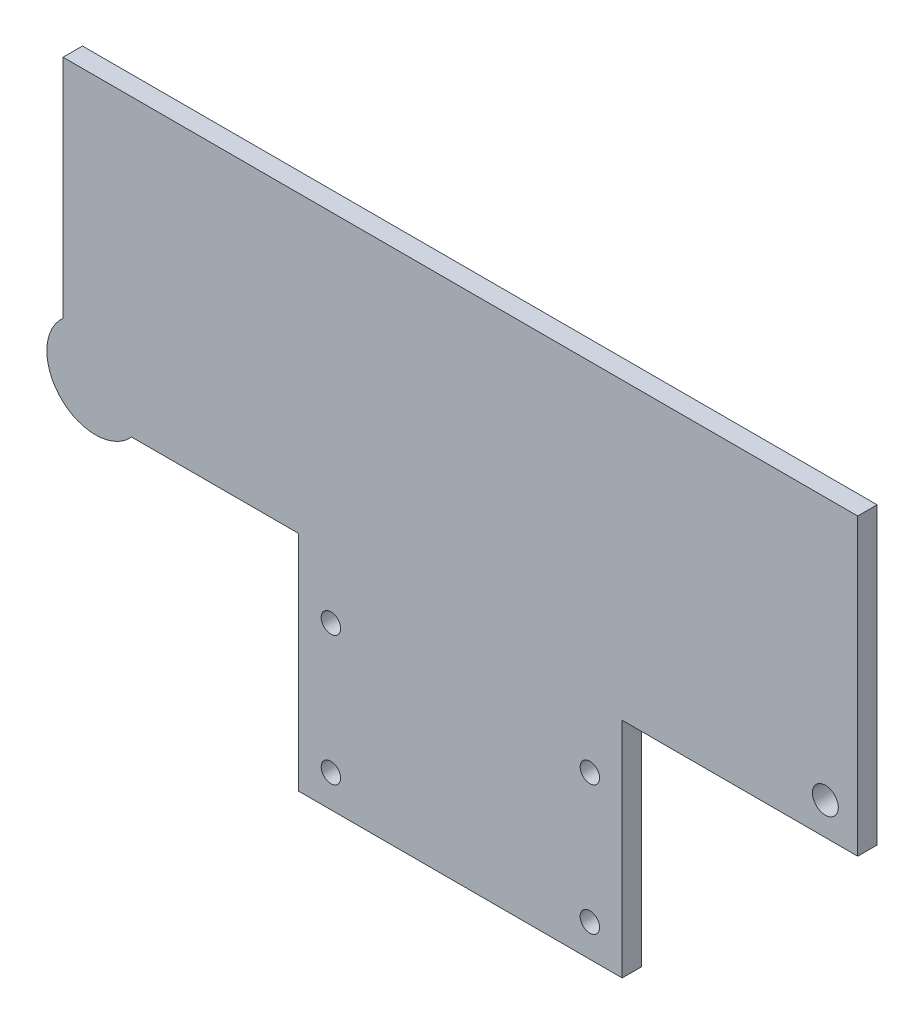
ISO-10303-21;
HEADER;
FILE_DESCRIPTION(('STEP AP214'),'2;1');
FILE_NAME('part.step','',(''),(''),'','','');
FILE_SCHEMA(('AUTOMOTIVE_DESIGN { 1 0 10303 214 1 1 1 1 }'));
ENDSEC;
DATA;
#1=APPLICATION_CONTEXT('core data for automotive mechanical design processes');
#2=APPLICATION_PROTOCOL_DEFINITION('international standard','automotive_design',2000,#1);
#3=PRODUCT_CONTEXT('',#1,'mechanical');
#4=PRODUCT('Part','Part','',(#3));
#5=PRODUCT_RELATED_PRODUCT_CATEGORY('part','',(#4));
#6=PRODUCT_DEFINITION_FORMATION('','',#4);
#7=PRODUCT_DEFINITION_CONTEXT('part definition',#1,'design');
#8=PRODUCT_DEFINITION('design','',#6,#7);
#9=PRODUCT_DEFINITION_SHAPE('','',#8);
#10=(LENGTH_UNIT() NAMED_UNIT(*) SI_UNIT(.MILLI.,.METRE.));
#11=(NAMED_UNIT(*) PLANE_ANGLE_UNIT() SI_UNIT($,.RADIAN.));
#12=(NAMED_UNIT(*) SI_UNIT($,.STERADIAN.) SOLID_ANGLE_UNIT());
#13=UNCERTAINTY_MEASURE_WITH_UNIT(LENGTH_MEASURE(1.E-05),#10,'distance_accuracy_value','');
#14=(GEOMETRIC_REPRESENTATION_CONTEXT(3) GLOBAL_UNCERTAINTY_ASSIGNED_CONTEXT((#13)) GLOBAL_UNIT_ASSIGNED_CONTEXT((#10,
#11,#12)) REPRESENTATION_CONTEXT('',''));
#15=CARTESIAN_POINT('',(0.,0.,0.));
#16=DIRECTION('',(0.,0.,1.));
#17=DIRECTION('',(1.,0.,0.));
#18=AXIS2_PLACEMENT_3D('',#15,#16,#17);
#19=CARTESIAN_POINT('',(-25.,-45.5212085995402,0.));
#20=DIRECTION('',(0.,0.,-1.));
#21=DIRECTION('',(-1.,0.,0.));
#22=AXIS2_PLACEMENT_3D('',#19,#20,#21);
#23=PLANE('',#22);
#24=DIRECTION('',(1.,0.,0.));
#25=VECTOR('',#24,1.);
#26=CARTESIAN_POINT('',(-61.3815572471545,-45.5212085995402,0.));
#27=LINE('',#26,#25);
#28=CARTESIAN_POINT('',(-50.791387303405,-45.5212085995402,0.));
#29=VERTEX_POINT('',#28);
#30=CARTESIAN_POINT('',(-25.,-45.5212085995402,0.));
#31=VERTEX_POINT('',#30);
#32=EDGE_CURVE('E82',#29,#31,#27,.T.);
#33=ORIENTED_EDGE('',*,*,#32,.F.);
#34=CARTESIAN_POINT('',(-56.3815572471545,-40.5212085995402,0.));
#35=DIRECTION('',(0.,0.,-1.));
#36=DIRECTION('',(-1.,0.,0.));
#37=AXIS2_PLACEMENT_3D('',#34,#35,#36);
#38=CIRCLE('',#37,7.50000000000001);
#39=CARTESIAN_POINT('',(-61.3815572471545,-34.9310386557907,0.));
#40=VERTEX_POINT('',#39);
#41=EDGE_CURVE('E215',#29,#40,#38,.F.);
#42=ORIENTED_EDGE('',*,*,#41,.T.);
#43=DIRECTION('',(0.,-1.,0.));
#44=VECTOR('',#43,1.);
#45=CARTESIAN_POINT('',(-61.3815572471545,0.,0.));
#46=LINE('',#45,#44);
#47=CARTESIAN_POINT('',(-61.3815572471545,0.,0.));
#48=VERTEX_POINT('',#47);
#49=EDGE_CURVE('E148',#48,#40,#46,.T.);
#50=ORIENTED_EDGE('',*,*,#49,.F.);
#51=DIRECTION('',(-1.,0.,0.));
#52=VECTOR('',#51,1.);
#53=CARTESIAN_POINT('',(-61.3815572471545,0.,0.));
#54=LINE('',#53,#52);
#55=CARTESIAN_POINT('',(61.3815572471545,0.,0.));
#56=VERTEX_POINT('',#55);
#57=EDGE_CURVE('E146',#56,#48,#54,.T.);
#58=ORIENTED_EDGE('',*,*,#57,.F.);
#59=DIRECTION('',(0.,1.,0.));
#60=VECTOR('',#59,1.);
#61=CARTESIAN_POINT('',(61.3815572471545,0.,0.));
#62=LINE('',#61,#60);
#63=CARTESIAN_POINT('',(61.3815572471545,-45.5212085995402,0.));
#64=VERTEX_POINT('',#63);
#65=EDGE_CURVE('E119',#64,#56,#62,.T.);
#66=ORIENTED_EDGE('',*,*,#65,.F.);
#67=DIRECTION('',(1.,0.,0.));
#68=VECTOR('',#67,1.);
#69=CARTESIAN_POINT('',(61.3815572471545,-45.5212085995402,0.));
#70=LINE('',#69,#68);
#71=CARTESIAN_POINT('',(25.,-45.5212085995402,0.));
#72=VERTEX_POINT('',#71);
#73=EDGE_CURVE('E143',#72,#64,#70,.T.);
#74=ORIENTED_EDGE('',*,*,#73,.F.);
#75=DIRECTION('',(0.,1.,0.));
#76=VECTOR('',#75,1.);
#77=CARTESIAN_POINT('',(25.,-80.,0.));
#78=LINE('',#77,#76);
#79=CARTESIAN_POINT('',(25.,-80.,0.));
#80=VERTEX_POINT('',#79);
#81=EDGE_CURVE('E141',#80,#72,#78,.T.);
#82=ORIENTED_EDGE('',*,*,#81,.F.);
#83=DIRECTION('',(1.,0.,0.));
#84=VECTOR('',#83,1.);
#85=CARTESIAN_POINT('',(25.,-80.,0.));
#86=LINE('',#85,#84);
#87=CARTESIAN_POINT('',(-25.,-80.,0.));
#88=VERTEX_POINT('',#87);
#89=EDGE_CURVE('E138',#88,#80,#86,.T.);
#90=ORIENTED_EDGE('',*,*,#89,.F.);
#91=DIRECTION('',(0.,-1.,0.));
#92=VECTOR('',#91,1.);
#93=CARTESIAN_POINT('',(-25.,-80.,0.));
#94=LINE('',#93,#92);
#95=EDGE_CURVE('E135',#31,#88,#94,.T.);
#96=ORIENTED_EDGE('',*,*,#95,.F.);
#97=EDGE_LOOP('',(#33,#42,#50,#58,#66,#74,#82,#90,#96));
#98=FACE_BOUND('',#97,.T.);
#99=CARTESIAN_POINT('',(56.3815572471545,-40.5212085995402,0.));
#100=DIRECTION('',(0.,0.,1.));
#101=DIRECTION('',(-1.,0.,0.));
#102=AXIS2_PLACEMENT_3D('',#99,#100,#101);
#103=CIRCLE('',#102,2.00000000000002);
#104=CARTESIAN_POINT('',(54.3815572471545,-40.5212085995402,0.));
#105=VERTEX_POINT('',#104);
#106=EDGE_CURVE('E207',#105,#105,#103,.T.);
#107=ORIENTED_EDGE('',*,*,#106,.T.);
#108=EDGE_LOOP('',(#107));
#109=FACE_BOUND('',#108,.T.);
#110=CARTESIAN_POINT('',(20.,-75.,0.));
#111=DIRECTION('',(0.,0.,1.));
#112=DIRECTION('',(1.,0.,0.));
#113=AXIS2_PLACEMENT_3D('',#110,#111,#112);
#114=CIRCLE('',#113,1.5);
#115=CARTESIAN_POINT('',(21.5,-75.,0.));
#116=VERTEX_POINT('',#115);
#117=EDGE_CURVE('E195',#116,#116,#114,.T.);
#118=ORIENTED_EDGE('',*,*,#117,.T.);
#119=EDGE_LOOP('',(#118));
#120=FACE_BOUND('',#119,.T.);
#121=CARTESIAN_POINT('',(-20.,-55.,0.));
#122=DIRECTION('',(0.,0.,1.));
#123=DIRECTION('',(1.,0.,0.));
#124=AXIS2_PLACEMENT_3D('',#121,#122,#123);
#125=CIRCLE('',#124,1.5);
#126=CARTESIAN_POINT('',(-18.5,-55.,0.));
#127=VERTEX_POINT('',#126);
#128=EDGE_CURVE('E183',#127,#127,#125,.T.);
#129=ORIENTED_EDGE('',*,*,#128,.T.);
#130=EDGE_LOOP('',(#129));
#131=FACE_BOUND('',#130,.T.);
#132=CARTESIAN_POINT('',(20.,-55.,0.));
#133=DIRECTION('',(0.,0.,1.));
#134=DIRECTION('',(-1.,0.,0.));
#135=AXIS2_PLACEMENT_3D('',#132,#133,#134);
#136=CIRCLE('',#135,1.5);
#137=CARTESIAN_POINT('',(18.5,-55.,0.));
#138=VERTEX_POINT('',#137);
#139=EDGE_CURVE('E189',#138,#138,#136,.T.);
#140=ORIENTED_EDGE('',*,*,#139,.T.);
#141=EDGE_LOOP('',(#140));
#142=FACE_BOUND('',#141,.T.);
#143=CARTESIAN_POINT('',(-20.,-75.,0.));
#144=DIRECTION('',(0.,0.,1.));
#145=DIRECTION('',(-1.,0.,0.));
#146=AXIS2_PLACEMENT_3D('',#143,#144,#145);
#147=CIRCLE('',#146,1.5);
#148=CARTESIAN_POINT('',(-21.5,-75.,0.));
#149=VERTEX_POINT('',#148);
#150=EDGE_CURVE('E201',#149,#149,#147,.T.);
#151=ORIENTED_EDGE('',*,*,#150,.T.);
#152=EDGE_LOOP('',(#151));
#153=FACE_BOUND('',#152,.T.);
#154=CARTESIAN_POINT('',(0.,-20.,0.));
#155=DIRECTION('',(0.,0.,-1.));
#156=DIRECTION('',(-1.,0.,0.));
#157=AXIS2_PLACEMENT_3D('',#154,#155,#156);
#158=CIRCLE('',#157,7.5);
#159=CARTESIAN_POINT('',(-7.50000000000001,-20.,0.));
#160=VERTEX_POINT('',#159);
#161=EDGE_CURVE('E219',#160,#160,#158,.F.);
#162=ORIENTED_EDGE('',*,*,#161,.T.);
#163=EDGE_LOOP('',(#162));
#164=FACE_BOUND('',#163,.T.);
#165=ADVANCED_FACE('F31',(#98,#109,#120,#131,#142,#153,#164),#23,.T.);
#166=CARTESIAN_POINT('',(-61.3815572471545,0.,3.));
#167=DIRECTION('',(1.,0.,0.));
#168=DIRECTION('',(0.,0.,-1.));
#169=AXIS2_PLACEMENT_3D('',#166,#167,#168);
#170=PLANE('',#169);
#171=DIRECTION('',(0.,0.,1.));
#172=VECTOR('',#171,1.);
#173=CARTESIAN_POINT('',(-61.3815572471545,-34.9310386557907,-3.));
#174=LINE('',#173,#172);
#175=CARTESIAN_POINT('',(-61.3815572471545,-34.9310386557907,3.));
#176=VERTEX_POINT('',#175);
#177=EDGE_CURVE('E210',#176,#40,#174,.F.);
#178=ORIENTED_EDGE('',*,*,#177,.F.);
#179=DIRECTION('',(0.,-1.,0.));
#180=VECTOR('',#179,1.);
#181=CARTESIAN_POINT('',(-61.3815572471545,0.,3.));
#182=LINE('',#181,#180);
#183=CARTESIAN_POINT('',(-61.3815572471545,0.,3.));
#184=VERTEX_POINT('',#183);
#185=EDGE_CURVE('E128',#184,#176,#182,.T.);
#186=ORIENTED_EDGE('',*,*,#185,.F.);
#187=DIRECTION('',(0.,0.,-1.));
#188=VECTOR('',#187,1.);
#189=CARTESIAN_POINT('',(-61.3815572471545,0.,3.));
#190=LINE('',#189,#188);
#191=EDGE_CURVE('E123',#184,#48,#190,.T.);
#192=ORIENTED_EDGE('',*,*,#191,.T.);
#193=ORIENTED_EDGE('',*,*,#49,.T.);
#194=EDGE_LOOP('',(#178,#186,#192,#193));
#195=FACE_BOUND('',#194,.T.);
#196=ADVANCED_FACE('F295',(#195),#170,.F.);
#197=CARTESIAN_POINT('',(-61.3815572471545,-45.5212085995402,3.));
#198=DIRECTION('',(0.,1.,0.));
#199=DIRECTION('',(0.,0.,1.));
#200=AXIS2_PLACEMENT_3D('',#197,#198,#199);
#201=PLANE('',#200);
#202=DIRECTION('',(0.,0.,1.));
#203=VECTOR('',#202,1.);
#204=CARTESIAN_POINT('',(-50.791387303405,-45.5212085995402,-3.));
#205=LINE('',#204,#203);
#206=CARTESIAN_POINT('',(-50.791387303405,-45.5212085995402,3.));
#207=VERTEX_POINT('',#206);
#208=EDGE_CURVE('E11',#29,#207,#205,.T.);
#209=ORIENTED_EDGE('',*,*,#208,.F.);
#210=ORIENTED_EDGE('',*,*,#32,.T.);
#211=DIRECTION('',(0.,0.,-1.));
#212=VECTOR('',#211,1.);
#213=CARTESIAN_POINT('',(-25.,-45.5212085995402,3.));
#214=LINE('',#213,#212);
#215=CARTESIAN_POINT('',(-25.,-45.5212085995402,3.));
#216=VERTEX_POINT('',#215);
#217=EDGE_CURVE('E134',#216,#31,#214,.T.);
#218=ORIENTED_EDGE('',*,*,#217,.F.);
#219=DIRECTION('',(1.,0.,0.));
#220=VECTOR('',#219,1.);
#221=CARTESIAN_POINT('',(-61.3815572471545,-45.5212085995402,3.));
#222=LINE('',#221,#220);
#223=EDGE_CURVE('E51',#207,#216,#222,.T.);
#224=ORIENTED_EDGE('',*,*,#223,.F.);
#225=EDGE_LOOP('',(#209,#210,#218,#224));
#226=FACE_BOUND('',#225,.T.);
#227=ADVANCED_FACE('F300',(#226),#201,.F.);
#228=CARTESIAN_POINT('',(-25.,-45.5212085995402,3.));
#229=DIRECTION('',(0.,0.,-1.));
#230=DIRECTION('',(-1.,0.,0.));
#231=AXIS2_PLACEMENT_3D('',#228,#229,#230);
#232=PLANE('',#231);
#233=CARTESIAN_POINT('',(56.3815572471545,-40.5212085995402,3.));
#234=DIRECTION('',(0.,0.,1.));
#235=DIRECTION('',(-1.,0.,0.));
#236=AXIS2_PLACEMENT_3D('',#233,#234,#235);
#237=CIRCLE('',#236,2.00000000000002);
#238=CARTESIAN_POINT('',(54.3815572471545,-40.5212085995402,3.));
#239=VERTEX_POINT('',#238);
#240=EDGE_CURVE('E204',#239,#239,#237,.T.);
#241=ORIENTED_EDGE('',*,*,#240,.F.);
#242=EDGE_LOOP('',(#241));
#243=FACE_BOUND('',#242,.T.);
#244=CARTESIAN_POINT('',(20.,-75.,3.));
#245=DIRECTION('',(0.,0.,1.));
#246=DIRECTION('',(1.,0.,0.));
#247=AXIS2_PLACEMENT_3D('',#244,#245,#246);
#248=CIRCLE('',#247,1.5);
#249=CARTESIAN_POINT('',(21.5,-75.,3.));
#250=VERTEX_POINT('',#249);
#251=EDGE_CURVE('E192',#250,#250,#248,.T.);
#252=ORIENTED_EDGE('',*,*,#251,.F.);
#253=EDGE_LOOP('',(#252));
#254=FACE_BOUND('',#253,.T.);
#255=CARTESIAN_POINT('',(-20.,-55.,3.));
#256=DIRECTION('',(0.,0.,1.));
#257=DIRECTION('',(1.,0.,0.));
#258=AXIS2_PLACEMENT_3D('',#255,#256,#257);
#259=CIRCLE('',#258,1.5);
#260=CARTESIAN_POINT('',(-18.5,-55.,3.));
#261=VERTEX_POINT('',#260);
#262=EDGE_CURVE('E139',#261,#261,#259,.T.);
#263=ORIENTED_EDGE('',*,*,#262,.F.);
#264=EDGE_LOOP('',(#263));
#265=FACE_BOUND('',#264,.T.);
#266=CARTESIAN_POINT('',(20.,-55.,3.));
#267=DIRECTION('',(0.,0.,1.));
#268=DIRECTION('',(-1.,0.,0.));
#269=AXIS2_PLACEMENT_3D('',#266,#267,#268);
#270=CIRCLE('',#269,1.5);
#271=CARTESIAN_POINT('',(18.5,-55.,3.));
#272=VERTEX_POINT('',#271);
#273=EDGE_CURVE('E186',#272,#272,#270,.T.);
#274=ORIENTED_EDGE('',*,*,#273,.F.);
#275=EDGE_LOOP('',(#274));
#276=FACE_BOUND('',#275,.T.);
#277=CARTESIAN_POINT('',(-20.,-75.,3.));
#278=DIRECTION('',(0.,0.,1.));
#279=DIRECTION('',(-1.,0.,0.));
#280=AXIS2_PLACEMENT_3D('',#277,#278,#279);
#281=CIRCLE('',#280,1.5);
#282=CARTESIAN_POINT('',(-21.5,-75.,3.));
#283=VERTEX_POINT('',#282);
#284=EDGE_CURVE('E198',#283,#283,#281,.T.);
#285=ORIENTED_EDGE('',*,*,#284,.F.);
#286=EDGE_LOOP('',(#285));
#287=FACE_BOUND('',#286,.T.);
#288=CARTESIAN_POINT('',(-56.3815572471545,-40.5212085995402,3.));
#289=DIRECTION('',(0.,0.,-1.));
#290=DIRECTION('',(-1.,0.,0.));
#291=AXIS2_PLACEMENT_3D('',#288,#289,#290);
#292=CIRCLE('',#291,7.50000000000001);
#293=EDGE_CURVE('E46',#207,#176,#292,.T.);
#294=ORIENTED_EDGE('',*,*,#293,.F.);
#295=ORIENTED_EDGE('',*,*,#223,.T.);
#296=DIRECTION('',(0.,-1.,0.));
#297=VECTOR('',#296,1.);
#298=CARTESIAN_POINT('',(-25.,-80.,3.));
#299=LINE('',#298,#297);
#300=CARTESIAN_POINT('',(-25.,-80.,3.));
#301=VERTEX_POINT('',#300);
#302=EDGE_CURVE('E152',#216,#301,#299,.T.);
#303=ORIENTED_EDGE('',*,*,#302,.T.);
#304=DIRECTION('',(1.,0.,0.));
#305=VECTOR('',#304,1.);
#306=CARTESIAN_POINT('',(25.,-80.,3.));
#307=LINE('',#306,#305);
#308=CARTESIAN_POINT('',(25.,-80.,3.));
#309=VERTEX_POINT('',#308);
#310=EDGE_CURVE('E91',#301,#309,#307,.T.);
#311=ORIENTED_EDGE('',*,*,#310,.T.);
#312=DIRECTION('',(0.,1.,0.));
#313=VECTOR('',#312,1.);
#314=CARTESIAN_POINT('',(25.,-80.,3.));
#315=LINE('',#314,#313);
#316=CARTESIAN_POINT('',(25.,-45.5212085995402,3.));
#317=VERTEX_POINT('',#316);
#318=EDGE_CURVE('E178',#309,#317,#315,.T.);
#319=ORIENTED_EDGE('',*,*,#318,.T.);
#320=DIRECTION('',(1.,0.,0.));
#321=VECTOR('',#320,1.);
#322=CARTESIAN_POINT('',(61.3815572471545,-45.5212085995402,3.));
#323=LINE('',#322,#321);
#324=CARTESIAN_POINT('',(61.3815572471545,-45.5212085995402,3.));
#325=VERTEX_POINT('',#324);
#326=EDGE_CURVE('E110',#317,#325,#323,.T.);
#327=ORIENTED_EDGE('',*,*,#326,.T.);
#328=DIRECTION('',(0.,1.,0.));
#329=VECTOR('',#328,1.);
#330=CARTESIAN_POINT('',(61.3815572471545,0.,3.));
#331=LINE('',#330,#329);
#332=CARTESIAN_POINT('',(61.3815572471545,0.,3.));
#333=VERTEX_POINT('',#332);
#334=EDGE_CURVE('E103',#325,#333,#331,.T.);
#335=ORIENTED_EDGE('',*,*,#334,.T.);
#336=DIRECTION('',(-1.,0.,0.));
#337=VECTOR('',#336,1.);
#338=CARTESIAN_POINT('',(-61.3815572471545,0.,3.));
#339=LINE('',#338,#337);
#340=EDGE_CURVE('E107',#333,#184,#339,.T.);
#341=ORIENTED_EDGE('',*,*,#340,.T.);
#342=ORIENTED_EDGE('',*,*,#185,.T.);
#343=EDGE_LOOP('',(#294,#295,#303,#311,#319,#327,#335,#341,#342));
#344=FACE_BOUND('',#343,.T.);
#345=ADVANCED_FACE('F105',(#243,#254,#265,#276,#287,#344),#232,.F.);
#346=CARTESIAN_POINT('',(-25.,-80.,3.));
#347=DIRECTION('',(1.,0.,0.));
#348=DIRECTION('',(0.,1.,0.));
#349=AXIS2_PLACEMENT_3D('',#346,#347,#348);
#350=PLANE('',#349);
#351=ORIENTED_EDGE('',*,*,#95,.T.);
#352=DIRECTION('',(0.,0.,-1.));
#353=VECTOR('',#352,1.);
#354=CARTESIAN_POINT('',(-25.,-80.,3.));
#355=LINE('',#354,#353);
#356=EDGE_CURVE('E39',#301,#88,#355,.T.);
#357=ORIENTED_EDGE('',*,*,#356,.F.);
#358=ORIENTED_EDGE('',*,*,#302,.F.);
#359=ORIENTED_EDGE('',*,*,#217,.T.);
#360=EDGE_LOOP('',(#351,#357,#358,#359));
#361=FACE_BOUND('',#360,.T.);
#362=ADVANCED_FACE('F33',(#361),#350,.F.);
#363=CARTESIAN_POINT('',(25.,-80.,3.));
#364=DIRECTION('',(0.,1.,0.));
#365=DIRECTION('',(0.,0.,1.));
#366=AXIS2_PLACEMENT_3D('',#363,#364,#365);
#367=PLANE('',#366);
#368=ORIENTED_EDGE('',*,*,#89,.T.);
#369=DIRECTION('',(0.,0.,-1.));
#370=VECTOR('',#369,1.);
#371=CARTESIAN_POINT('',(25.,-80.,3.));
#372=LINE('',#371,#370);
#373=EDGE_CURVE('E159',#309,#80,#372,.T.);
#374=ORIENTED_EDGE('',*,*,#373,.F.);
#375=ORIENTED_EDGE('',*,*,#310,.F.);
#376=ORIENTED_EDGE('',*,*,#356,.T.);
#377=EDGE_LOOP('',(#368,#374,#375,#376));
#378=FACE_BOUND('',#377,.T.);
#379=ADVANCED_FACE('F162',(#378),#367,.F.);
#380=CARTESIAN_POINT('',(25.,-80.,3.));
#381=DIRECTION('',(-1.,0.,0.));
#382=DIRECTION('',(0.,-1.,0.));
#383=AXIS2_PLACEMENT_3D('',#380,#381,#382);
#384=PLANE('',#383);
#385=ORIENTED_EDGE('',*,*,#81,.T.);
#386=DIRECTION('',(0.,0.,-1.));
#387=VECTOR('',#386,1.);
#388=CARTESIAN_POINT('',(25.,-45.5212085995402,3.));
#389=LINE('',#388,#387);
#390=EDGE_CURVE('E156',#317,#72,#389,.T.);
#391=ORIENTED_EDGE('',*,*,#390,.F.);
#392=ORIENTED_EDGE('',*,*,#318,.F.);
#393=ORIENTED_EDGE('',*,*,#373,.T.);
#394=EDGE_LOOP('',(#385,#391,#392,#393));
#395=FACE_BOUND('',#394,.T.);
#396=ADVANCED_FACE('F174',(#395),#384,.F.);
#397=CARTESIAN_POINT('',(61.3815572471545,-45.5212085995402,3.));
#398=DIRECTION('',(0.,1.,0.));
#399=DIRECTION('',(0.,0.,1.));
#400=AXIS2_PLACEMENT_3D('',#397,#398,#399);
#401=PLANE('',#400);
#402=ORIENTED_EDGE('',*,*,#73,.T.);
#403=DIRECTION('',(0.,0.,-1.));
#404=VECTOR('',#403,1.);
#405=CARTESIAN_POINT('',(61.3815572471545,-45.5212085995402,3.));
#406=LINE('',#405,#404);
#407=EDGE_CURVE('E122',#325,#64,#406,.T.);
#408=ORIENTED_EDGE('',*,*,#407,.F.);
#409=ORIENTED_EDGE('',*,*,#326,.F.);
#410=ORIENTED_EDGE('',*,*,#390,.T.);
#411=EDGE_LOOP('',(#402,#408,#409,#410));
#412=FACE_BOUND('',#411,.T.);
#413=ADVANCED_FACE('F177',(#412),#401,.F.);
#414=CARTESIAN_POINT('',(61.3815572471545,0.,3.));
#415=DIRECTION('',(-1.,0.,0.));
#416=DIRECTION('',(0.,0.,1.));
#417=AXIS2_PLACEMENT_3D('',#414,#415,#416);
#418=PLANE('',#417);
#419=ORIENTED_EDGE('',*,*,#65,.T.);
#420=DIRECTION('',(0.,0.,-1.));
#421=VECTOR('',#420,1.);
#422=CARTESIAN_POINT('',(61.3815572471545,0.,3.));
#423=LINE('',#422,#421);
#424=EDGE_CURVE('E116',#333,#56,#423,.T.);
#425=ORIENTED_EDGE('',*,*,#424,.F.);
#426=ORIENTED_EDGE('',*,*,#334,.F.);
#427=ORIENTED_EDGE('',*,*,#407,.T.);
#428=EDGE_LOOP('',(#419,#425,#426,#427));
#429=FACE_BOUND('',#428,.T.);
#430=ADVANCED_FACE('F117',(#429),#418,.F.);
#431=CARTESIAN_POINT('',(-61.3815572471545,0.,3.));
#432=DIRECTION('',(0.,-1.,0.));
#433=DIRECTION('',(0.,0.,-1.));
#434=AXIS2_PLACEMENT_3D('',#431,#432,#433);
#435=PLANE('',#434);
#436=ORIENTED_EDGE('',*,*,#57,.T.);
#437=ORIENTED_EDGE('',*,*,#191,.F.);
#438=ORIENTED_EDGE('',*,*,#340,.F.);
#439=ORIENTED_EDGE('',*,*,#424,.T.);
#440=EDGE_LOOP('',(#436,#437,#438,#439));
#441=FACE_BOUND('',#440,.T.);
#442=ADVANCED_FACE('F125',(#441),#435,.F.);
#443=CARTESIAN_POINT('',(-20.,-55.,3.));
#444=DIRECTION('',(0.,0.,-1.));
#445=DIRECTION('',(-1.,0.,0.));
#446=AXIS2_PLACEMENT_3D('',#443,#444,#445);
#447=CYLINDRICAL_SURFACE('',#446,1.5);
#448=ORIENTED_EDGE('',*,*,#262,.T.);
#449=EDGE_LOOP('',(#448));
#450=FACE_BOUND('',#449,.T.);
#451=ORIENTED_EDGE('',*,*,#128,.F.);
#452=EDGE_LOOP('',(#451));
#453=FACE_BOUND('',#452,.T.);
#454=ADVANCED_FACE('F310',(#450,#453),#447,.F.);
#455=CARTESIAN_POINT('',(20.,-55.,3.));
#456=DIRECTION('',(0.,0.,-1.));
#457=DIRECTION('',(-1.,0.,0.));
#458=AXIS2_PLACEMENT_3D('',#455,#456,#457);
#459=CYLINDRICAL_SURFACE('',#458,1.5);
#460=ORIENTED_EDGE('',*,*,#273,.T.);
#461=EDGE_LOOP('',(#460));
#462=FACE_BOUND('',#461,.T.);
#463=ORIENTED_EDGE('',*,*,#139,.F.);
#464=EDGE_LOOP('',(#463));
#465=FACE_BOUND('',#464,.T.);
#466=ADVANCED_FACE('F351',(#462,#465),#459,.F.);
#467=CARTESIAN_POINT('',(20.,-75.,3.));
#468=DIRECTION('',(0.,0.,-1.));
#469=DIRECTION('',(-1.,0.,0.));
#470=AXIS2_PLACEMENT_3D('',#467,#468,#469);
#471=CYLINDRICAL_SURFACE('',#470,1.5);
#472=ORIENTED_EDGE('',*,*,#251,.T.);
#473=EDGE_LOOP('',(#472));
#474=FACE_BOUND('',#473,.T.);
#475=ORIENTED_EDGE('',*,*,#117,.F.);
#476=EDGE_LOOP('',(#475));
#477=FACE_BOUND('',#476,.T.);
#478=ADVANCED_FACE('F340',(#474,#477),#471,.F.);
#479=CARTESIAN_POINT('',(-20.,-75.,3.));
#480=DIRECTION('',(0.,0.,-1.));
#481=DIRECTION('',(-1.,0.,0.));
#482=AXIS2_PLACEMENT_3D('',#479,#480,#481);
#483=CYLINDRICAL_SURFACE('',#482,1.5);
#484=ORIENTED_EDGE('',*,*,#284,.T.);
#485=EDGE_LOOP('',(#484));
#486=FACE_BOUND('',#485,.T.);
#487=ORIENTED_EDGE('',*,*,#150,.F.);
#488=EDGE_LOOP('',(#487));
#489=FACE_BOUND('',#488,.T.);
#490=ADVANCED_FACE('F336',(#486,#489),#483,.F.);
#491=CARTESIAN_POINT('',(56.3815572471545,-40.5212085995402,3.));
#492=DIRECTION('',(0.,0.,-1.));
#493=DIRECTION('',(-1.,0.,0.));
#494=AXIS2_PLACEMENT_3D('',#491,#492,#493);
#495=CYLINDRICAL_SURFACE('',#494,2.00000000000002);
#496=ORIENTED_EDGE('',*,*,#240,.T.);
#497=EDGE_LOOP('',(#496));
#498=FACE_BOUND('',#497,.T.);
#499=ORIENTED_EDGE('',*,*,#106,.F.);
#500=EDGE_LOOP('',(#499));
#501=FACE_BOUND('',#500,.T.);
#502=ADVANCED_FACE('F339',(#498,#501),#495,.F.);
#503=CARTESIAN_POINT('',(-56.3815572471545,-40.5212085995402,-3.));
#504=DIRECTION('',(0.,0.,1.));
#505=DIRECTION('',(1.,0.,0.));
#506=AXIS2_PLACEMENT_3D('',#503,#504,#505);
#507=CYLINDRICAL_SURFACE('',#506,7.50000000000001);
#508=CARTESIAN_POINT('',(-56.3815572471545,-40.5212085995402,-3.));
#509=DIRECTION('',(0.,0.,-1.));
#510=DIRECTION('',(-1.,0.,0.));
#511=AXIS2_PLACEMENT_3D('',#508,#509,#510);
#512=CIRCLE('',#511,7.50000000000001);
#513=CARTESIAN_POINT('',(-63.8815572471545,-40.5212085995402,-3.));
#514=VERTEX_POINT('',#513);
#515=EDGE_CURVE('E217',#514,#514,#512,.T.);
#516=ORIENTED_EDGE('',*,*,#515,.F.);
#517=EDGE_LOOP('',(#516));
#518=FACE_BOUND('',#517,.T.);
#519=ORIENTED_EDGE('',*,*,#293,.T.);
#520=ORIENTED_EDGE('',*,*,#177,.T.);
#521=ORIENTED_EDGE('',*,*,#41,.F.);
#522=ORIENTED_EDGE('',*,*,#208,.T.);
#523=EDGE_LOOP('',(#519,#520,#521,#522));
#524=FACE_BOUND('',#523,.T.);
#525=ADVANCED_FACE('F290',(#518,#524),#507,.T.);
#526=CARTESIAN_POINT('',(-56.3815572471545,-40.5212085995402,-3.));
#527=DIRECTION('',(0.,0.,-1.));
#528=DIRECTION('',(-1.,0.,0.));
#529=AXIS2_PLACEMENT_3D('',#526,#527,#528);
#530=PLANE('',#529);
#531=CARTESIAN_POINT('',(-56.3815572471545,-40.5212085995402,-3.));
#532=DIRECTION('',(0.,0.,-1.));
#533=DIRECTION('',(-1.,0.,0.));
#534=AXIS2_PLACEMENT_3D('',#531,#532,#533);
#535=CIRCLE('',#534,3.875);
#536=CARTESIAN_POINT('',(-60.2565572471545,-40.5212085995402,-3.));
#537=VERTEX_POINT('',#536);
#538=EDGE_CURVE('E228',#537,#537,#535,.T.);
#539=ORIENTED_EDGE('',*,*,#538,.F.);
#540=EDGE_LOOP('',(#539));
#541=FACE_BOUND('',#540,.T.);
#542=ORIENTED_EDGE('',*,*,#515,.T.);
#543=EDGE_LOOP('',(#542));
#544=FACE_BOUND('',#543,.T.);
#545=ADVANCED_FACE('F284',(#541,#544),#530,.T.);
#546=CARTESIAN_POINT('',(0.,-20.,-3.));
#547=DIRECTION('',(0.,0.,1.));
#548=DIRECTION('',(1.,0.,0.));
#549=AXIS2_PLACEMENT_3D('',#546,#547,#548);
#550=CYLINDRICAL_SURFACE('',#549,7.5);
#551=ORIENTED_EDGE('',*,*,#161,.F.);
#552=EDGE_LOOP('',(#551));
#553=FACE_BOUND('',#552,.T.);
#554=CARTESIAN_POINT('',(0.,-20.,-3.));
#555=DIRECTION('',(0.,0.,-1.));
#556=DIRECTION('',(-1.,0.,0.));
#557=AXIS2_PLACEMENT_3D('',#554,#555,#556);
#558=CIRCLE('',#557,7.5);
#559=CARTESIAN_POINT('',(-7.50000000000001,-20.,-3.));
#560=VERTEX_POINT('',#559);
#561=EDGE_CURVE('E224',#560,#560,#558,.T.);
#562=ORIENTED_EDGE('',*,*,#561,.F.);
#563=EDGE_LOOP('',(#562));
#564=FACE_BOUND('',#563,.T.);
#565=ADVANCED_FACE('F279',(#553,#564),#550,.T.);
#566=CARTESIAN_POINT('',(0.,-20.,-3.));
#567=DIRECTION('',(0.,0.,-1.));
#568=DIRECTION('',(-1.,0.,0.));
#569=AXIS2_PLACEMENT_3D('',#566,#567,#568);
#570=PLANE('',#569);
#571=CARTESIAN_POINT('',(0.,-20.,-3.));
#572=DIRECTION('',(0.,0.,-1.));
#573=DIRECTION('',(-1.,0.,0.));
#574=AXIS2_PLACEMENT_3D('',#571,#572,#573);
#575=CIRCLE('',#574,3.875);
#576=CARTESIAN_POINT('',(-3.87500000000001,-20.,-3.));
#577=VERTEX_POINT('',#576);
#578=EDGE_CURVE('E234',#577,#577,#575,.T.);
#579=ORIENTED_EDGE('',*,*,#578,.F.);
#580=EDGE_LOOP('',(#579));
#581=FACE_BOUND('',#580,.T.);
#582=ORIENTED_EDGE('',*,*,#561,.T.);
#583=EDGE_LOOP('',(#582));
#584=FACE_BOUND('',#583,.T.);
#585=ADVANCED_FACE('F275',(#581,#584),#570,.T.);
#586=CARTESIAN_POINT('',(-56.3815572471545,-40.5212085995402,-2.));
#587=DIRECTION('',(0.,0.,-1.));
#588=DIRECTION('',(-1.,0.,0.));
#589=AXIS2_PLACEMENT_3D('',#586,#587,#588);
#590=CYLINDRICAL_SURFACE('',#589,3.875);
#591=CARTESIAN_POINT('',(-56.3815572471545,-40.5212085995402,-2.));
#592=DIRECTION('',(0.,0.,-1.));
#593=DIRECTION('',(-1.,0.,0.));
#594=AXIS2_PLACEMENT_3D('',#591,#592,#593);
#595=CIRCLE('',#594,3.875);
#596=CARTESIAN_POINT('',(-60.2565572471545,-40.5212085995402,-2.));
#597=VERTEX_POINT('',#596);
#598=EDGE_CURVE('E227',#597,#597,#595,.T.);
#599=ORIENTED_EDGE('',*,*,#598,.F.);
#600=EDGE_LOOP('',(#599));
#601=FACE_BOUND('',#600,.T.);
#602=ORIENTED_EDGE('',*,*,#538,.T.);
#603=EDGE_LOOP('',(#602));
#604=FACE_BOUND('',#603,.T.);
#605=ADVANCED_FACE('F278',(#601,#604),#590,.F.);
#606=CARTESIAN_POINT('',(-56.3815572471545,-40.5212085995402,-2.));
#607=DIRECTION('',(0.,0.,-1.));
#608=DIRECTION('',(-1.,0.,0.));
#609=AXIS2_PLACEMENT_3D('',#606,#607,#608);
#610=PLANE('',#609);
#611=CARTESIAN_POINT('',(-56.3815572471545,-40.5212085995402,-2.));
#612=DIRECTION('',(0.,0.,-1.));
#613=DIRECTION('',(-1.,0.,0.));
#614=AXIS2_PLACEMENT_3D('',#611,#612,#613);
#615=CIRCLE('',#614,2.375);
#616=CARTESIAN_POINT('',(-58.7565572471545,-40.5212085995402,-2.));
#617=VERTEX_POINT('',#616);
#618=EDGE_CURVE('E240',#617,#617,#615,.T.);
#619=ORIENTED_EDGE('',*,*,#618,.F.);
#620=EDGE_LOOP('',(#619));
#621=FACE_BOUND('',#620,.T.);
#622=ORIENTED_EDGE('',*,*,#598,.T.);
#623=EDGE_LOOP('',(#622));
#624=FACE_BOUND('',#623,.T.);
#625=ADVANCED_FACE('F271',(#621,#624),#610,.T.);
#626=CARTESIAN_POINT('',(0.,-20.,-2.));
#627=DIRECTION('',(0.,0.,-1.));
#628=DIRECTION('',(-1.,0.,0.));
#629=AXIS2_PLACEMENT_3D('',#626,#627,#628);
#630=CYLINDRICAL_SURFACE('',#629,3.875);
#631=CARTESIAN_POINT('',(0.,-20.,-2.));
#632=DIRECTION('',(0.,0.,-1.));
#633=DIRECTION('',(-1.,0.,0.));
#634=AXIS2_PLACEMENT_3D('',#631,#632,#633);
#635=CIRCLE('',#634,3.875);
#636=CARTESIAN_POINT('',(-3.87500000000001,-20.,-2.));
#637=VERTEX_POINT('',#636);
#638=EDGE_CURVE('E231',#637,#637,#635,.T.);
#639=ORIENTED_EDGE('',*,*,#638,.F.);
#640=EDGE_LOOP('',(#639));
#641=FACE_BOUND('',#640,.T.);
#642=ORIENTED_EDGE('',*,*,#578,.T.);
#643=EDGE_LOOP('',(#642));
#644=FACE_BOUND('',#643,.T.);
#645=ADVANCED_FACE('F265',(#641,#644),#630,.F.);
#646=CARTESIAN_POINT('',(0.,-20.,-2.));
#647=DIRECTION('',(0.,0.,-1.));
#648=DIRECTION('',(-1.,0.,0.));
#649=AXIS2_PLACEMENT_3D('',#646,#647,#648);
#650=PLANE('',#649);
#651=CARTESIAN_POINT('',(0.,-20.,-2.));
#652=DIRECTION('',(0.,0.,-1.));
#653=DIRECTION('',(-1.,0.,0.));
#654=AXIS2_PLACEMENT_3D('',#651,#652,#653);
#655=CIRCLE('',#654,2.375);
#656=CARTESIAN_POINT('',(-2.37500000000001,-20.,-2.));
#657=VERTEX_POINT('',#656);
#658=EDGE_CURVE('E246',#657,#657,#655,.T.);
#659=ORIENTED_EDGE('',*,*,#658,.F.);
#660=EDGE_LOOP('',(#659));
#661=FACE_BOUND('',#660,.T.);
#662=ORIENTED_EDGE('',*,*,#638,.T.);
#663=EDGE_LOOP('',(#662));
#664=FACE_BOUND('',#663,.T.);
#665=ADVANCED_FACE('F261',(#661,#664),#650,.T.);
#666=CARTESIAN_POINT('',(-56.3815572471545,-40.5212085995402,2.));
#667=DIRECTION('',(0.,0.,-1.));
#668=DIRECTION('',(-1.,0.,0.));
#669=AXIS2_PLACEMENT_3D('',#666,#667,#668);
#670=CYLINDRICAL_SURFACE('',#669,2.375);
#671=CARTESIAN_POINT('',(-56.3815572471545,-40.5212085995402,2.));
#672=DIRECTION('',(0.,0.,-1.));
#673=DIRECTION('',(-1.,0.,0.));
#674=AXIS2_PLACEMENT_3D('',#671,#672,#673);
#675=CIRCLE('',#674,2.375);
#676=CARTESIAN_POINT('',(-58.7565572471545,-40.5212085995402,2.));
#677=VERTEX_POINT('',#676);
#678=EDGE_CURVE('E237',#677,#677,#675,.T.);
#679=ORIENTED_EDGE('',*,*,#678,.F.);
#680=EDGE_LOOP('',(#679));
#681=FACE_BOUND('',#680,.T.);
#682=ORIENTED_EDGE('',*,*,#618,.T.);
#683=EDGE_LOOP('',(#682));
#684=FACE_BOUND('',#683,.T.);
#685=ADVANCED_FACE('F264',(#681,#684),#670,.F.);
#686=CARTESIAN_POINT('',(-56.3815572471545,-40.5212085995402,2.));
#687=DIRECTION('',(0.,0.,-1.));
#688=DIRECTION('',(-1.,0.,0.));
#689=AXIS2_PLACEMENT_3D('',#686,#687,#688);
#690=PLANE('',#689);
#691=ORIENTED_EDGE('',*,*,#678,.T.);
#692=EDGE_LOOP('',(#691));
#693=FACE_BOUND('',#692,.T.);
#694=ADVANCED_FACE('F257',(#693),#690,.T.);
#695=CARTESIAN_POINT('',(0.,-20.,2.));
#696=DIRECTION('',(0.,0.,-1.));
#697=DIRECTION('',(-1.,0.,0.));
#698=AXIS2_PLACEMENT_3D('',#695,#696,#697);
#699=CYLINDRICAL_SURFACE('',#698,2.375);
#700=CARTESIAN_POINT('',(0.,-20.,2.));
#701=DIRECTION('',(0.,0.,-1.));
#702=DIRECTION('',(-1.,0.,0.));
#703=AXIS2_PLACEMENT_3D('',#700,#701,#702);
#704=CIRCLE('',#703,2.375);
#705=CARTESIAN_POINT('',(-2.37500000000001,-20.,2.));
#706=VERTEX_POINT('',#705);
#707=EDGE_CURVE('E243',#706,#706,#704,.T.);
#708=ORIENTED_EDGE('',*,*,#707,.F.);
#709=EDGE_LOOP('',(#708));
#710=FACE_BOUND('',#709,.T.);
#711=ORIENTED_EDGE('',*,*,#658,.T.);
#712=EDGE_LOOP('',(#711));
#713=FACE_BOUND('',#712,.T.);
#714=ADVANCED_FACE('F254',(#710,#713),#699,.F.);
#715=CARTESIAN_POINT('',(0.,-20.,2.));
#716=DIRECTION('',(0.,0.,-1.));
#717=DIRECTION('',(-1.,0.,0.));
#718=AXIS2_PLACEMENT_3D('',#715,#716,#717);
#719=PLANE('',#718);
#720=ORIENTED_EDGE('',*,*,#707,.T.);
#721=EDGE_LOOP('',(#720));
#722=FACE_BOUND('',#721,.T.);
#723=ADVANCED_FACE('F252',(#722),#719,.T.);
#724=CLOSED_SHELL('',(#165,#196,#227,#345,#362,#379,#396,#413,#430,#442,#454,#466,#478,#490,
#502,#525,#545,#565,#585,#605,#625,#645,#665,#685,#694,#714,#723));
#725=MANIFOLD_SOLID_BREP('B2',#724);
#726=ADVANCED_BREP_SHAPE_REPRESENTATION('',(#18,#725),#14);
#727=SHAPE_DEFINITION_REPRESENTATION(#9,#726);
ENDSEC;
END-ISO-10303-21;
